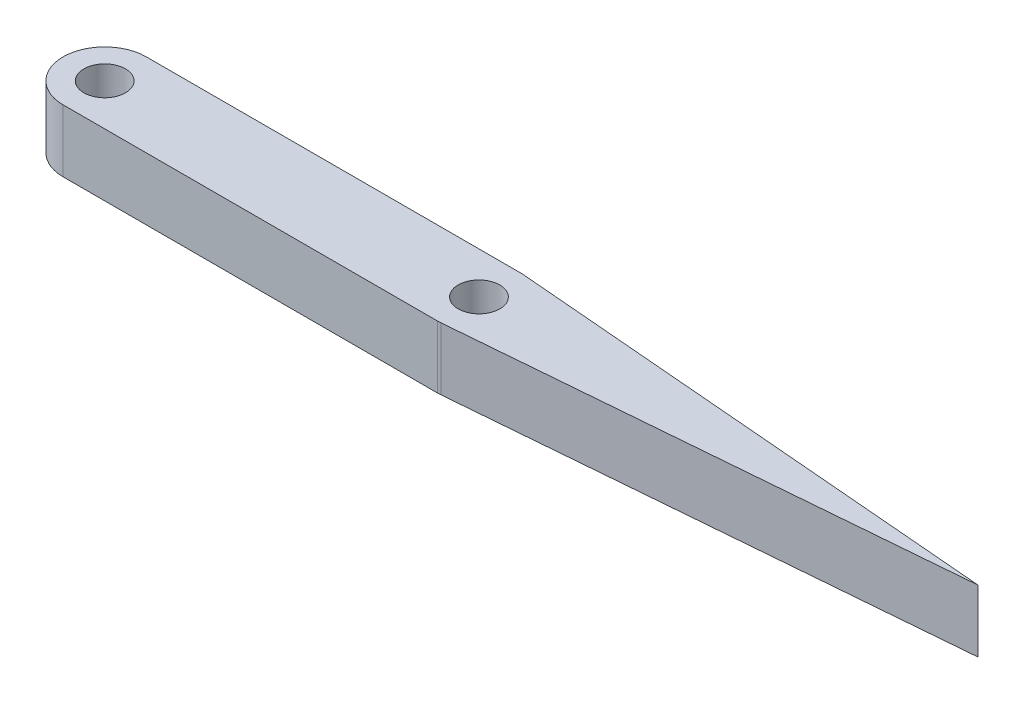
ISO-10303-21;
HEADER;
FILE_DESCRIPTION(('STEP AP214'),'2;1');
FILE_NAME('part.step','',(''),(''),'','','');
FILE_SCHEMA(('AUTOMOTIVE_DESIGN { 1 0 10303 214 1 1 1 1 }'));
ENDSEC;
DATA;
#1=APPLICATION_CONTEXT('core data for automotive mechanical design processes');
#2=APPLICATION_PROTOCOL_DEFINITION('international standard','automotive_design',2000,#1);
#3=PRODUCT_CONTEXT('',#1,'mechanical');
#4=PRODUCT('Part','Part','',(#3));
#5=PRODUCT_RELATED_PRODUCT_CATEGORY('part','',(#4));
#6=PRODUCT_DEFINITION_FORMATION('','',#4);
#7=PRODUCT_DEFINITION_CONTEXT('part definition',#1,'design');
#8=PRODUCT_DEFINITION('design','',#6,#7);
#9=PRODUCT_DEFINITION_SHAPE('','',#8);
#10=(LENGTH_UNIT() NAMED_UNIT(*) SI_UNIT(.MILLI.,.METRE.));
#11=(NAMED_UNIT(*) PLANE_ANGLE_UNIT() SI_UNIT($,.RADIAN.));
#12=(NAMED_UNIT(*) SI_UNIT($,.STERADIAN.) SOLID_ANGLE_UNIT());
#13=UNCERTAINTY_MEASURE_WITH_UNIT(LENGTH_MEASURE(1.E-05),#10,'distance_accuracy_value','');
#14=(GEOMETRIC_REPRESENTATION_CONTEXT(3) GLOBAL_UNCERTAINTY_ASSIGNED_CONTEXT((#13)) GLOBAL_UNIT_ASSIGNED_CONTEXT((#10,
#11,#12)) REPRESENTATION_CONTEXT('',''));
#15=CARTESIAN_POINT('',(0.,0.,0.));
#16=DIRECTION('',(0.,0.,1.));
#17=DIRECTION('',(1.,0.,0.));
#18=AXIS2_PLACEMENT_3D('',#15,#16,#17);
#19=CARTESIAN_POINT('',(18.,3.,0.));
#20=DIRECTION('',(0.,1.,0.));
#21=DIRECTION('',(0.,0.,1.));
#22=AXIS2_PLACEMENT_3D('',#19,#20,#21);
#23=PLANE('',#22);
#24=CARTESIAN_POINT('',(0.,3.,0.));
#25=DIRECTION('',(0.,1.,0.));
#26=DIRECTION('',(0.,0.,1.));
#27=AXIS2_PLACEMENT_3D('',#24,#25,#26);
#28=CIRCLE('',#27,1.);
#29=CARTESIAN_POINT('',(0.,3.,1.));
#30=VERTEX_POINT('',#29);
#31=EDGE_CURVE('E128',#30,#30,#28,.T.);
#32=ORIENTED_EDGE('',*,*,#31,.F.);
#33=EDGE_LOOP('',(#32));
#34=FACE_BOUND('',#33,.T.);
#35=CARTESIAN_POINT('',(18.,3.,0.));
#36=DIRECTION('',(0.,1.,0.));
#37=DIRECTION('',(0.,0.,1.));
#38=AXIS2_PLACEMENT_3D('',#35,#36,#37);
#39=CIRCLE('',#38,2.);
#40=CARTESIAN_POINT('',(18.1666666666667,3.,-1.99304345718357));
#41=VERTEX_POINT('',#40);
#42=CARTESIAN_POINT('',(18.,3.,-2.));
#43=VERTEX_POINT('',#42);
#44=EDGE_CURVE('E137',#41,#43,#39,.T.);
#45=ORIENTED_EDGE('',*,*,#44,.T.);
#46=DIRECTION('',(-1.,0.,0.));
#47=VECTOR('',#46,1.);
#48=CARTESIAN_POINT('',(0.,3.,-2.));
#49=LINE('',#48,#47);
#50=CARTESIAN_POINT('',(0.,3.,-2.));
#51=VERTEX_POINT('',#50);
#52=EDGE_CURVE('E90',#43,#51,#49,.T.);
#53=ORIENTED_EDGE('',*,*,#52,.T.);
#54=CARTESIAN_POINT('',(0.,3.,0.));
#55=DIRECTION('',(0.,1.,0.));
#56=DIRECTION('',(0.,0.,1.));
#57=AXIS2_PLACEMENT_3D('',#54,#55,#56);
#58=CIRCLE('',#57,2.);
#59=CARTESIAN_POINT('',(0.,3.,2.));
#60=VERTEX_POINT('',#59);
#61=EDGE_CURVE('E149',#51,#60,#58,.T.);
#62=ORIENTED_EDGE('',*,*,#61,.T.);
#63=DIRECTION('',(1.,0.,0.));
#64=VECTOR('',#63,1.);
#65=CARTESIAN_POINT('',(18.,3.,2.));
#66=LINE('',#65,#64);
#67=CARTESIAN_POINT('',(18.,3.,2.));
#68=VERTEX_POINT('',#67);
#69=EDGE_CURVE('E106',#60,#68,#66,.T.);
#70=ORIENTED_EDGE('',*,*,#69,.T.);
#71=CARTESIAN_POINT('',(18.,3.,0.));
#72=DIRECTION('',(0.,1.,0.));
#73=DIRECTION('',(0.,0.,1.));
#74=AXIS2_PLACEMENT_3D('',#71,#72,#73);
#75=CIRCLE('',#74,2.);
#76=CARTESIAN_POINT('',(18.1666666666667,3.,1.99304345718357));
#77=VERTEX_POINT('',#76);
#78=EDGE_CURVE('E100',#68,#77,#75,.T.);
#79=ORIENTED_EDGE('',*,*,#78,.T.);
#80=DIRECTION('',(0.996521728591783,0.,-0.0833333333333333));
#81=VECTOR('',#80,1.);
#82=CARTESIAN_POINT('',(18.1666666666667,3.,1.99304345718357));
#83=LINE('',#82,#81);
#84=CARTESIAN_POINT('',(42.,3.,0.));
#85=VERTEX_POINT('',#84);
#86=EDGE_CURVE('E104',#77,#85,#83,.T.);
#87=ORIENTED_EDGE('',*,*,#86,.T.);
#88=DIRECTION('',(-0.996521728591783,0.,-0.0833333333333333));
#89=VECTOR('',#88,1.);
#90=CARTESIAN_POINT('',(18.1666666666667,3.,-1.99304345718357));
#91=LINE('',#90,#89);
#92=EDGE_CURVE('E50',#85,#41,#91,.T.);
#93=ORIENTED_EDGE('',*,*,#92,.T.);
#94=EDGE_LOOP('',(#45,#53,#62,#70,#79,#87,#93));
#95=FACE_BOUND('',#94,.T.);
#96=CARTESIAN_POINT('',(18.,3.,0.));
#97=DIRECTION('',(0.,1.,0.));
#98=DIRECTION('',(0.,0.,1.));
#99=AXIS2_PLACEMENT_3D('',#96,#97,#98);
#100=CIRCLE('',#99,1.);
#101=CARTESIAN_POINT('',(18.,3.,1.));
#102=VERTEX_POINT('',#101);
#103=EDGE_CURVE('E164',#102,#102,#100,.T.);
#104=ORIENTED_EDGE('',*,*,#103,.F.);
#105=EDGE_LOOP('',(#104));
#106=FACE_BOUND('',#105,.T.);
#107=ADVANCED_FACE('F33',(#34,#95,#106),#23,.T.);
#108=CARTESIAN_POINT('',(18.,0.,0.));
#109=DIRECTION('',(0.,1.,0.));
#110=DIRECTION('',(0.,0.,1.));
#111=AXIS2_PLACEMENT_3D('',#108,#109,#110);
#112=PLANE('',#111);
#113=CARTESIAN_POINT('',(18.,0.,0.));
#114=DIRECTION('',(0.,1.,0.));
#115=DIRECTION('',(0.,0.,1.));
#116=AXIS2_PLACEMENT_3D('',#113,#114,#115);
#117=CIRCLE('',#116,2.);
#118=CARTESIAN_POINT('',(18.1666666666667,0.,-1.99304345718357));
#119=VERTEX_POINT('',#118);
#120=CARTESIAN_POINT('',(18.,0.,-2.));
#121=VERTEX_POINT('',#120);
#122=EDGE_CURVE('E124',#119,#121,#117,.T.);
#123=ORIENTED_EDGE('',*,*,#122,.F.);
#124=DIRECTION('',(-0.996521728591783,0.,-0.0833333333333333));
#125=VECTOR('',#124,1.);
#126=CARTESIAN_POINT('',(18.1666666666667,0.,-1.99304345718357));
#127=LINE('',#126,#125);
#128=CARTESIAN_POINT('',(42.,0.,0.));
#129=VERTEX_POINT('',#128);
#130=EDGE_CURVE('E82',#129,#119,#127,.T.);
#131=ORIENTED_EDGE('',*,*,#130,.F.);
#132=DIRECTION('',(0.996521728591783,0.,-0.0833333333333333));
#133=VECTOR('',#132,1.);
#134=CARTESIAN_POINT('',(18.1666666666667,0.,1.99304345718357));
#135=LINE('',#134,#133);
#136=CARTESIAN_POINT('',(18.1666666666667,0.,1.99304345718357));
#137=VERTEX_POINT('',#136);
#138=EDGE_CURVE('E76',#137,#129,#135,.T.);
#139=ORIENTED_EDGE('',*,*,#138,.F.);
#140=CARTESIAN_POINT('',(18.,0.,0.));
#141=DIRECTION('',(0.,1.,0.));
#142=DIRECTION('',(0.,0.,1.));
#143=AXIS2_PLACEMENT_3D('',#140,#141,#142);
#144=CIRCLE('',#143,2.);
#145=CARTESIAN_POINT('',(18.,0.,2.));
#146=VERTEX_POINT('',#145);
#147=EDGE_CURVE('E114',#146,#137,#144,.T.);
#148=ORIENTED_EDGE('',*,*,#147,.F.);
#149=DIRECTION('',(1.,0.,0.));
#150=VECTOR('',#149,1.);
#151=CARTESIAN_POINT('',(18.,0.,2.));
#152=LINE('',#151,#150);
#153=CARTESIAN_POINT('',(0.,0.,2.));
#154=VERTEX_POINT('',#153);
#155=EDGE_CURVE('E132',#154,#146,#152,.T.);
#156=ORIENTED_EDGE('',*,*,#155,.F.);
#157=CARTESIAN_POINT('',(0.,0.,0.));
#158=DIRECTION('',(0.,1.,0.));
#159=DIRECTION('',(0.,0.,1.));
#160=AXIS2_PLACEMENT_3D('',#157,#158,#159);
#161=CIRCLE('',#160,2.);
#162=CARTESIAN_POINT('',(0.,0.,-2.));
#163=VERTEX_POINT('',#162);
#164=EDGE_CURVE('E130',#163,#154,#161,.T.);
#165=ORIENTED_EDGE('',*,*,#164,.F.);
#166=DIRECTION('',(-1.,0.,0.));
#167=VECTOR('',#166,1.);
#168=CARTESIAN_POINT('',(0.,0.,-2.));
#169=LINE('',#168,#167);
#170=EDGE_CURVE('E127',#121,#163,#169,.T.);
#171=ORIENTED_EDGE('',*,*,#170,.F.);
#172=EDGE_LOOP('',(#123,#131,#139,#148,#156,#165,#171));
#173=FACE_BOUND('',#172,.T.);
#174=CARTESIAN_POINT('',(0.,0.,0.));
#175=DIRECTION('',(0.,1.,0.));
#176=DIRECTION('',(0.,0.,1.));
#177=AXIS2_PLACEMENT_3D('',#174,#175,#176);
#178=CIRCLE('',#177,1.);
#179=CARTESIAN_POINT('',(0.,0.,1.));
#180=VERTEX_POINT('',#179);
#181=EDGE_CURVE('E161',#180,#180,#178,.T.);
#182=ORIENTED_EDGE('',*,*,#181,.T.);
#183=EDGE_LOOP('',(#182));
#184=FACE_BOUND('',#183,.T.);
#185=CARTESIAN_POINT('',(18.,0.,0.));
#186=DIRECTION('',(0.,1.,0.));
#187=DIRECTION('',(0.,0.,1.));
#188=AXIS2_PLACEMENT_3D('',#185,#186,#187);
#189=CIRCLE('',#188,1.);
#190=CARTESIAN_POINT('',(18.,0.,1.));
#191=VERTEX_POINT('',#190);
#192=EDGE_CURVE('E167',#191,#191,#189,.T.);
#193=ORIENTED_EDGE('',*,*,#192,.T.);
#194=EDGE_LOOP('',(#193));
#195=FACE_BOUND('',#194,.T.);
#196=ADVANCED_FACE('F153',(#173,#184,#195),#112,.F.);
#197=CARTESIAN_POINT('',(18.,3.,0.));
#198=DIRECTION('',(0.,-1.,0.));
#199=DIRECTION('',(0.,0.,-1.));
#200=AXIS2_PLACEMENT_3D('',#197,#198,#199);
#201=CYLINDRICAL_SURFACE('',#200,2.);
#202=ORIENTED_EDGE('',*,*,#122,.T.);
#203=DIRECTION('',(0.,-1.,0.));
#204=VECTOR('',#203,1.);
#205=CARTESIAN_POINT('',(18.,3.,-2.));
#206=LINE('',#205,#204);
#207=EDGE_CURVE('E11',#43,#121,#206,.T.);
#208=ORIENTED_EDGE('',*,*,#207,.F.);
#209=ORIENTED_EDGE('',*,*,#44,.F.);
#210=DIRECTION('',(0.,-1.,0.));
#211=VECTOR('',#210,1.);
#212=CARTESIAN_POINT('',(18.1666666666667,3.,-1.99304345718357));
#213=LINE('',#212,#211);
#214=EDGE_CURVE('E120',#41,#119,#213,.T.);
#215=ORIENTED_EDGE('',*,*,#214,.T.);
#216=EDGE_LOOP('',(#202,#208,#209,#215));
#217=FACE_BOUND('',#216,.T.);
#218=ADVANCED_FACE('F35',(#217),#201,.T.);
#219=CARTESIAN_POINT('',(0.,3.,-2.));
#220=DIRECTION('',(0.,0.,1.));
#221=DIRECTION('',(1.,0.,0.));
#222=AXIS2_PLACEMENT_3D('',#219,#220,#221);
#223=PLANE('',#222);
#224=ORIENTED_EDGE('',*,*,#170,.T.);
#225=DIRECTION('',(0.,-1.,0.));
#226=VECTOR('',#225,1.);
#227=CARTESIAN_POINT('',(0.,3.,-2.));
#228=LINE('',#227,#226);
#229=EDGE_CURVE('E42',#51,#163,#228,.T.);
#230=ORIENTED_EDGE('',*,*,#229,.F.);
#231=ORIENTED_EDGE('',*,*,#52,.F.);
#232=ORIENTED_EDGE('',*,*,#207,.T.);
#233=EDGE_LOOP('',(#224,#230,#231,#232));
#234=FACE_BOUND('',#233,.T.);
#235=ADVANCED_FACE('F197',(#234),#223,.F.);
#236=CARTESIAN_POINT('',(0.,3.,0.));
#237=DIRECTION('',(0.,-1.,0.));
#238=DIRECTION('',(0.,0.,-1.));
#239=AXIS2_PLACEMENT_3D('',#236,#237,#238);
#240=CYLINDRICAL_SURFACE('',#239,2.);
#241=ORIENTED_EDGE('',*,*,#164,.T.);
#242=DIRECTION('',(0.,-1.,0.));
#243=VECTOR('',#242,1.);
#244=CARTESIAN_POINT('',(0.,3.,2.));
#245=LINE('',#244,#243);
#246=EDGE_CURVE('E141',#60,#154,#245,.T.);
#247=ORIENTED_EDGE('',*,*,#246,.F.);
#248=ORIENTED_EDGE('',*,*,#61,.F.);
#249=ORIENTED_EDGE('',*,*,#229,.T.);
#250=EDGE_LOOP('',(#241,#247,#248,#249));
#251=FACE_BOUND('',#250,.T.);
#252=ADVANCED_FACE('F147',(#251),#240,.T.);
#253=CARTESIAN_POINT('',(18.,3.,2.));
#254=DIRECTION('',(0.,0.,-1.));
#255=DIRECTION('',(-1.,0.,0.));
#256=AXIS2_PLACEMENT_3D('',#253,#254,#255);
#257=PLANE('',#256);
#258=ORIENTED_EDGE('',*,*,#155,.T.);
#259=DIRECTION('',(0.,-1.,0.));
#260=VECTOR('',#259,1.);
#261=CARTESIAN_POINT('',(18.,3.,2.));
#262=LINE('',#261,#260);
#263=EDGE_CURVE('E115',#68,#146,#262,.T.);
#264=ORIENTED_EDGE('',*,*,#263,.F.);
#265=ORIENTED_EDGE('',*,*,#69,.F.);
#266=ORIENTED_EDGE('',*,*,#246,.T.);
#267=EDGE_LOOP('',(#258,#264,#265,#266));
#268=FACE_BOUND('',#267,.T.);
#269=ADVANCED_FACE('F156',(#268),#257,.F.);
#270=CARTESIAN_POINT('',(18.,3.,0.));
#271=DIRECTION('',(0.,-1.,0.));
#272=DIRECTION('',(0.,0.,-1.));
#273=AXIS2_PLACEMENT_3D('',#270,#271,#272);
#274=CYLINDRICAL_SURFACE('',#273,2.);
#275=ORIENTED_EDGE('',*,*,#147,.T.);
#276=DIRECTION('',(0.,-1.,0.));
#277=VECTOR('',#276,1.);
#278=CARTESIAN_POINT('',(18.1666666666667,3.,1.99304345718357));
#279=LINE('',#278,#277);
#280=EDGE_CURVE('E111',#77,#137,#279,.T.);
#281=ORIENTED_EDGE('',*,*,#280,.F.);
#282=ORIENTED_EDGE('',*,*,#78,.F.);
#283=ORIENTED_EDGE('',*,*,#263,.T.);
#284=EDGE_LOOP('',(#275,#281,#282,#283));
#285=FACE_BOUND('',#284,.T.);
#286=ADVANCED_FACE('F112',(#285),#274,.T.);
#287=CARTESIAN_POINT('',(18.1666666666667,3.,1.99304345718357));
#288=DIRECTION('',(-0.0833333333333333,0.,-0.996521728591783));
#289=DIRECTION('',(-0.996521728591783,0.,0.0833333333333333));
#290=AXIS2_PLACEMENT_3D('',#287,#288,#289);
#291=PLANE('',#290);
#292=ORIENTED_EDGE('',*,*,#138,.T.);
#293=DIRECTION('',(0.,-1.,0.));
#294=VECTOR('',#293,1.);
#295=CARTESIAN_POINT('',(42.,3.,0.));
#296=LINE('',#295,#294);
#297=EDGE_CURVE('E116',#85,#129,#296,.T.);
#298=ORIENTED_EDGE('',*,*,#297,.F.);
#299=ORIENTED_EDGE('',*,*,#86,.F.);
#300=ORIENTED_EDGE('',*,*,#280,.T.);
#301=EDGE_LOOP('',(#292,#298,#299,#300));
#302=FACE_BOUND('',#301,.T.);
#303=ADVANCED_FACE('F118',(#302),#291,.F.);
#304=CARTESIAN_POINT('',(18.1666666666667,3.,-1.99304345718357));
#305=DIRECTION('',(-0.0833333333333333,0.,0.996521728591783));
#306=DIRECTION('',(0.996521728591783,0.,0.0833333333333333));
#307=AXIS2_PLACEMENT_3D('',#304,#305,#306);
#308=PLANE('',#307);
#309=ORIENTED_EDGE('',*,*,#130,.T.);
#310=ORIENTED_EDGE('',*,*,#214,.F.);
#311=ORIENTED_EDGE('',*,*,#92,.F.);
#312=ORIENTED_EDGE('',*,*,#297,.T.);
#313=EDGE_LOOP('',(#309,#310,#311,#312));
#314=FACE_BOUND('',#313,.T.);
#315=ADVANCED_FACE('F187',(#314),#308,.F.);
#316=CARTESIAN_POINT('',(0.,3.,0.));
#317=DIRECTION('',(0.,-1.,0.));
#318=DIRECTION('',(0.,0.,-1.));
#319=AXIS2_PLACEMENT_3D('',#316,#317,#318);
#320=CYLINDRICAL_SURFACE('',#319,1.);
#321=ORIENTED_EDGE('',*,*,#31,.T.);
#322=EDGE_LOOP('',(#321));
#323=FACE_BOUND('',#322,.T.);
#324=ORIENTED_EDGE('',*,*,#181,.F.);
#325=EDGE_LOOP('',(#324));
#326=FACE_BOUND('',#325,.T.);
#327=ADVANCED_FACE('F184',(#323,#326),#320,.F.);
#328=CARTESIAN_POINT('',(18.,3.,0.));
#329=DIRECTION('',(0.,-1.,0.));
#330=DIRECTION('',(0.,0.,-1.));
#331=AXIS2_PLACEMENT_3D('',#328,#329,#330);
#332=CYLINDRICAL_SURFACE('',#331,1.);
#333=ORIENTED_EDGE('',*,*,#103,.T.);
#334=EDGE_LOOP('',(#333));
#335=FACE_BOUND('',#334,.T.);
#336=ORIENTED_EDGE('',*,*,#192,.F.);
#337=EDGE_LOOP('',(#336));
#338=FACE_BOUND('',#337,.T.);
#339=ADVANCED_FACE('F173',(#335,#338),#332,.F.);
#340=CLOSED_SHELL('',(#107,#196,#218,#235,#252,#269,#286,#303,#315,#327,#339));
#341=MANIFOLD_SOLID_BREP('B2',#340);
#342=ADVANCED_BREP_SHAPE_REPRESENTATION('',(#18,#341),#14);
#343=SHAPE_DEFINITION_REPRESENTATION(#9,#342);
ENDSEC;
END-ISO-10303-21;
